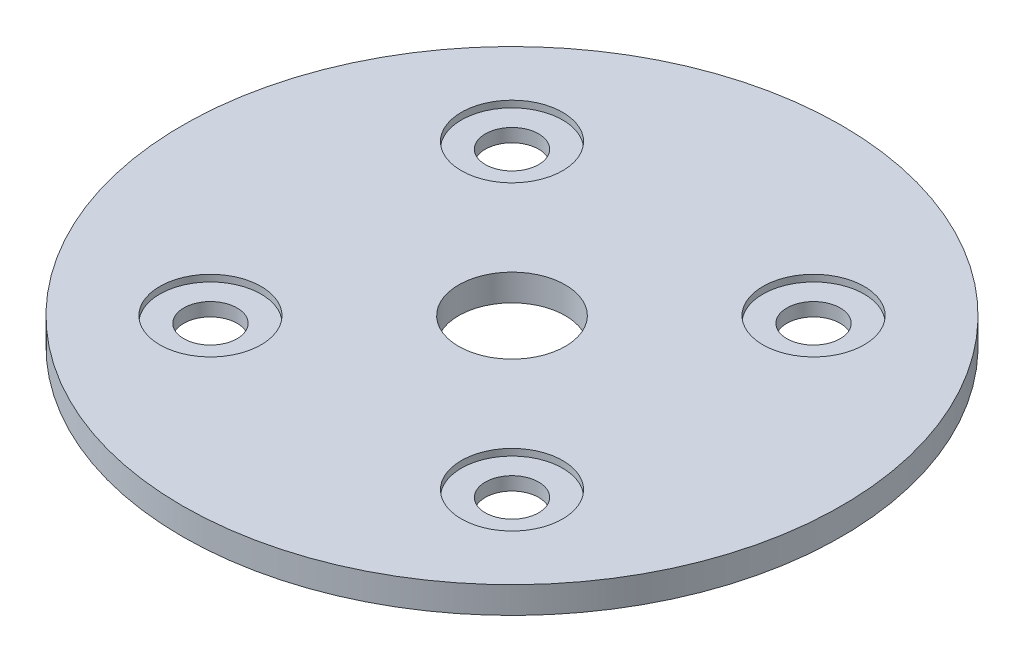
ISO-10303-21;
HEADER;
FILE_DESCRIPTION(('STEP AP214'),'2;1');
FILE_NAME('part.step','',(''),(''),'','','');
FILE_SCHEMA(('AUTOMOTIVE_DESIGN { 1 0 10303 214 1 1 1 1 }'));
ENDSEC;
DATA;
#1=APPLICATION_CONTEXT('core data for automotive mechanical design processes');
#2=APPLICATION_PROTOCOL_DEFINITION('international standard','automotive_design',2000,#1);
#3=PRODUCT_CONTEXT('',#1,'mechanical');
#4=PRODUCT('Part','Part','',(#3));
#5=PRODUCT_RELATED_PRODUCT_CATEGORY('part','',(#4));
#6=PRODUCT_DEFINITION_FORMATION('','',#4);
#7=PRODUCT_DEFINITION_CONTEXT('part definition',#1,'design');
#8=PRODUCT_DEFINITION('design','',#6,#7);
#9=PRODUCT_DEFINITION_SHAPE('','',#8);
#10=(LENGTH_UNIT() NAMED_UNIT(*) SI_UNIT(.MILLI.,.METRE.));
#11=(NAMED_UNIT(*) PLANE_ANGLE_UNIT() SI_UNIT($,.RADIAN.));
#12=(NAMED_UNIT(*) SI_UNIT($,.STERADIAN.) SOLID_ANGLE_UNIT());
#13=UNCERTAINTY_MEASURE_WITH_UNIT(LENGTH_MEASURE(1.E-05),#10,'distance_accuracy_value','');
#14=(GEOMETRIC_REPRESENTATION_CONTEXT(3) GLOBAL_UNCERTAINTY_ASSIGNED_CONTEXT((#13)) GLOBAL_UNIT_ASSIGNED_CONTEXT((#10,
#11,#12)) REPRESENTATION_CONTEXT('',''));
#15=CARTESIAN_POINT('',(0.,0.,0.));
#16=DIRECTION('',(0.,0.,1.));
#17=DIRECTION('',(1.,0.,0.));
#18=AXIS2_PLACEMENT_3D('',#15,#16,#17);
#19=CARTESIAN_POINT('',(-17.9605122421383,1.5875,17.9605122421383));
#20=DIRECTION('',(0.,1.,0.));
#21=DIRECTION('',(0.,0.,1.));
#22=AXIS2_PLACEMENT_3D('',#19,#20,#21);
#23=CYLINDRICAL_SURFACE('',#22,3.175);
#24=CARTESIAN_POINT('',(-17.9605122421383,0.79375,17.9605122421383));
#25=DIRECTION('',(0.,1.,0.));
#26=DIRECTION('',(0.,0.,1.));
#27=AXIS2_PLACEMENT_3D('',#24,#25,#26);
#28=CIRCLE('',#27,3.175);
#29=CARTESIAN_POINT('',(-17.9605122421383,0.79375,21.1355122421383));
#30=VERTEX_POINT('',#29);
#31=EDGE_CURVE('E65',#30,#30,#28,.F.);
#32=ORIENTED_EDGE('',*,*,#31,.F.);
#33=EDGE_LOOP('',(#32));
#34=FACE_BOUND('',#33,.T.);
#35=CARTESIAN_POINT('',(-17.9605122421383,-0.79375,17.9605122421383));
#36=DIRECTION('',(0.,-1.,0.));
#37=DIRECTION('',(0.,0.,-1.));
#38=AXIS2_PLACEMENT_3D('',#35,#36,#37);
#39=CIRCLE('',#38,3.175);
#40=CARTESIAN_POINT('',(-17.9605122421383,-0.79375,14.7855122421383));
#41=VERTEX_POINT('',#40);
#42=EDGE_CURVE('E41',#41,#41,#39,.F.);
#43=ORIENTED_EDGE('',*,*,#42,.F.);
#44=EDGE_LOOP('',(#43));
#45=FACE_BOUND('',#44,.T.);
#46=ADVANCED_FACE('F37',(#34,#45),#23,.F.);
#47=CARTESIAN_POINT('',(17.9605122421383,1.5875,17.9605122421383));
#48=DIRECTION('',(0.,1.,0.));
#49=DIRECTION('',(0.,0.,1.));
#50=AXIS2_PLACEMENT_3D('',#47,#48,#49);
#51=CYLINDRICAL_SURFACE('',#50,3.175);
#52=CARTESIAN_POINT('',(17.9605122421383,0.79375,17.9605122421383));
#53=DIRECTION('',(0.,1.,0.));
#54=DIRECTION('',(0.,0.,1.));
#55=AXIS2_PLACEMENT_3D('',#52,#53,#54);
#56=CIRCLE('',#55,3.175);
#57=CARTESIAN_POINT('',(17.9605122421383,0.79375,21.1355122421383));
#58=VERTEX_POINT('',#57);
#59=EDGE_CURVE('E62',#58,#58,#56,.F.);
#60=ORIENTED_EDGE('',*,*,#59,.F.);
#61=EDGE_LOOP('',(#60));
#62=FACE_BOUND('',#61,.T.);
#63=CARTESIAN_POINT('',(17.9605122421383,-0.79375,17.9605122421383));
#64=DIRECTION('',(0.,-1.,0.));
#65=DIRECTION('',(0.,0.,-1.));
#66=AXIS2_PLACEMENT_3D('',#63,#64,#65);
#67=CIRCLE('',#66,3.175);
#68=CARTESIAN_POINT('',(17.9605122421383,-0.79375,14.7855122421383));
#69=VERTEX_POINT('',#68);
#70=EDGE_CURVE('E75',#69,#69,#67,.F.);
#71=ORIENTED_EDGE('',*,*,#70,.F.);
#72=EDGE_LOOP('',(#71));
#73=FACE_BOUND('',#72,.T.);
#74=ADVANCED_FACE('F125',(#62,#73),#51,.F.);
#75=CARTESIAN_POINT('',(17.9605122421383,1.5875,-17.9605122421383));
#76=DIRECTION('',(0.,1.,0.));
#77=DIRECTION('',(0.,0.,1.));
#78=AXIS2_PLACEMENT_3D('',#75,#76,#77);
#79=CYLINDRICAL_SURFACE('',#78,3.175);
#80=CARTESIAN_POINT('',(17.9605122421383,0.79375,-17.9605122421383));
#81=DIRECTION('',(0.,1.,0.));
#82=DIRECTION('',(0.,0.,1.));
#83=AXIS2_PLACEMENT_3D('',#80,#81,#82);
#84=CIRCLE('',#83,3.175);
#85=CARTESIAN_POINT('',(17.9605122421383,0.79375,-14.7855122421383));
#86=VERTEX_POINT('',#85);
#87=EDGE_CURVE('E58',#86,#86,#84,.F.);
#88=ORIENTED_EDGE('',*,*,#87,.F.);
#89=EDGE_LOOP('',(#88));
#90=FACE_BOUND('',#89,.T.);
#91=CARTESIAN_POINT('',(17.9605122421383,-0.79375,-17.9605122421383));
#92=DIRECTION('',(0.,-1.,0.));
#93=DIRECTION('',(0.,0.,-1.));
#94=AXIS2_PLACEMENT_3D('',#91,#92,#93);
#95=CIRCLE('',#94,3.175);
#96=CARTESIAN_POINT('',(17.9605122421383,-0.79375,-21.1355122421383));
#97=VERTEX_POINT('',#96);
#98=EDGE_CURVE('E72',#97,#97,#95,.F.);
#99=ORIENTED_EDGE('',*,*,#98,.F.);
#100=EDGE_LOOP('',(#99));
#101=FACE_BOUND('',#100,.T.);
#102=ADVANCED_FACE('F132',(#90,#101),#79,.F.);
#103=CARTESIAN_POINT('',(-17.9605122421383,1.5875,-17.9605122421383));
#104=DIRECTION('',(0.,1.,0.));
#105=DIRECTION('',(0.,0.,1.));
#106=AXIS2_PLACEMENT_3D('',#103,#104,#105);
#107=CYLINDRICAL_SURFACE('',#106,3.175);
#108=CARTESIAN_POINT('',(-17.9605122421383,0.79375,-17.9605122421383));
#109=DIRECTION('',(0.,1.,0.));
#110=DIRECTION('',(0.,0.,1.));
#111=AXIS2_PLACEMENT_3D('',#108,#109,#110);
#112=CIRCLE('',#111,3.175);
#113=CARTESIAN_POINT('',(-17.9605122421383,0.79375,-14.7855122421383));
#114=VERTEX_POINT('',#113);
#115=EDGE_CURVE('E55',#114,#114,#112,.F.);
#116=ORIENTED_EDGE('',*,*,#115,.F.);
#117=EDGE_LOOP('',(#116));
#118=FACE_BOUND('',#117,.T.);
#119=CARTESIAN_POINT('',(-17.9605122421383,-0.79375,-17.9605122421383));
#120=DIRECTION('',(0.,-1.,0.));
#121=DIRECTION('',(0.,0.,-1.));
#122=AXIS2_PLACEMENT_3D('',#119,#120,#121);
#123=CIRCLE('',#122,3.175);
#124=CARTESIAN_POINT('',(-17.9605122421383,-0.79375,-21.1355122421383));
#125=VERTEX_POINT('',#124);
#126=EDGE_CURVE('E69',#125,#125,#123,.F.);
#127=ORIENTED_EDGE('',*,*,#126,.F.);
#128=EDGE_LOOP('',(#127));
#129=FACE_BOUND('',#128,.T.);
#130=ADVANCED_FACE('F142',(#118,#129),#107,.F.);
#131=CARTESIAN_POINT('',(0.,1.5875,0.));
#132=DIRECTION('',(0.,-1.,0.));
#133=DIRECTION('',(0.,0.,-1.));
#134=AXIS2_PLACEMENT_3D('',#131,#132,#133);
#135=CYLINDRICAL_SURFACE('',#134,39.2557);
#136=CARTESIAN_POINT('',(0.,1.5875,0.));
#137=DIRECTION('',(0.,1.,0.));
#138=DIRECTION('',(0.,0.,1.));
#139=AXIS2_PLACEMENT_3D('',#136,#137,#138);
#140=CIRCLE('',#139,39.2557);
#141=CARTESIAN_POINT('',(0.,1.5875,39.2557));
#142=VERTEX_POINT('',#141);
#143=EDGE_CURVE('E10',#142,#142,#140,.T.);
#144=ORIENTED_EDGE('',*,*,#143,.F.);
#145=EDGE_LOOP('',(#144));
#146=FACE_BOUND('',#145,.T.);
#147=CARTESIAN_POINT('',(0.,-1.5875,0.));
#148=DIRECTION('',(0.,1.,0.));
#149=DIRECTION('',(0.,0.,1.));
#150=AXIS2_PLACEMENT_3D('',#147,#148,#149);
#151=CIRCLE('',#150,39.2557);
#152=CARTESIAN_POINT('',(0.,-1.5875,39.2557));
#153=VERTEX_POINT('',#152);
#154=EDGE_CURVE('E45',#153,#153,#151,.T.);
#155=ORIENTED_EDGE('',*,*,#154,.T.);
#156=EDGE_LOOP('',(#155));
#157=FACE_BOUND('',#156,.T.);
#158=ADVANCED_FACE('F39',(#146,#157),#135,.T.);
#159=CARTESIAN_POINT('',(0.,1.5875,0.));
#160=DIRECTION('',(0.,1.,0.));
#161=DIRECTION('',(0.,0.,1.));
#162=AXIS2_PLACEMENT_3D('',#159,#160,#161);
#163=PLANE('',#162);
#164=CARTESIAN_POINT('',(-17.9605122421383,1.5875,17.9605122421383));
#165=DIRECTION('',(0.,1.,0.));
#166=DIRECTION('',(0.,0.,1.));
#167=AXIS2_PLACEMENT_3D('',#164,#165,#166);
#168=CIRCLE('',#167,6.0325);
#169=CARTESIAN_POINT('',(-17.9605122421383,1.5875,23.9930122421383));
#170=VERTEX_POINT('',#169);
#171=EDGE_CURVE('E84',#170,#170,#168,.T.);
#172=ORIENTED_EDGE('',*,*,#171,.F.);
#173=EDGE_LOOP('',(#172));
#174=FACE_BOUND('',#173,.T.);
#175=CARTESIAN_POINT('',(17.9605122421383,1.5875,17.9605122421383));
#176=DIRECTION('',(0.,1.,0.));
#177=DIRECTION('',(0.,0.,1.));
#178=AXIS2_PLACEMENT_3D('',#175,#176,#177);
#179=CIRCLE('',#178,6.0325);
#180=CARTESIAN_POINT('',(17.9605122421383,1.5875,23.9930122421383));
#181=VERTEX_POINT('',#180);
#182=EDGE_CURVE('E149',#181,#181,#179,.T.);
#183=ORIENTED_EDGE('',*,*,#182,.F.);
#184=EDGE_LOOP('',(#183));
#185=FACE_BOUND('',#184,.T.);
#186=CARTESIAN_POINT('',(17.9605122421383,1.5875,-17.9605122421383));
#187=DIRECTION('',(0.,1.,0.));
#188=DIRECTION('',(0.,0.,1.));
#189=AXIS2_PLACEMENT_3D('',#186,#187,#188);
#190=CIRCLE('',#189,6.0325);
#191=CARTESIAN_POINT('',(17.9605122421383,1.5875,-11.9280122421383));
#192=VERTEX_POINT('',#191);
#193=EDGE_CURVE('E97',#192,#192,#190,.T.);
#194=ORIENTED_EDGE('',*,*,#193,.F.);
#195=EDGE_LOOP('',(#194));
#196=FACE_BOUND('',#195,.T.);
#197=CARTESIAN_POINT('',(-17.9605122421383,1.5875,-17.9605122421383));
#198=DIRECTION('',(0.,1.,0.));
#199=DIRECTION('',(0.,0.,1.));
#200=AXIS2_PLACEMENT_3D('',#197,#198,#199);
#201=CIRCLE('',#200,6.0325);
#202=CARTESIAN_POINT('',(-17.9605122421383,1.5875,-11.9280122421383));
#203=VERTEX_POINT('',#202);
#204=EDGE_CURVE('E95',#203,#203,#201,.T.);
#205=ORIENTED_EDGE('',*,*,#204,.F.);
#206=EDGE_LOOP('',(#205));
#207=FACE_BOUND('',#206,.T.);
#208=CARTESIAN_POINT('',(0.,1.5875,0.));
#209=DIRECTION('',(0.,1.,0.));
#210=DIRECTION('',(0.,0.,1.));
#211=AXIS2_PLACEMENT_3D('',#208,#209,#210);
#212=CIRCLE('',#211,6.35);
#213=CARTESIAN_POINT('',(0.,1.5875,6.35));
#214=VERTEX_POINT('',#213);
#215=EDGE_CURVE('E68',#214,#214,#212,.T.);
#216=ORIENTED_EDGE('',*,*,#215,.F.);
#217=EDGE_LOOP('',(#216));
#218=FACE_BOUND('',#217,.T.);
#219=ORIENTED_EDGE('',*,*,#143,.T.);
#220=EDGE_LOOP('',(#219));
#221=FACE_BOUND('',#220,.T.);
#222=ADVANCED_FACE('F120',(#174,#185,#196,#207,#218,#221),#163,.T.);
#223=CARTESIAN_POINT('',(0.,-1.5875,0.));
#224=DIRECTION('',(0.,1.,0.));
#225=DIRECTION('',(0.,0.,1.));
#226=AXIS2_PLACEMENT_3D('',#223,#224,#225);
#227=PLANE('',#226);
#228=CARTESIAN_POINT('',(-17.9605122421383,-1.5875,17.9605122421383));
#229=DIRECTION('',(0.,1.,0.));
#230=DIRECTION('',(0.,0.,1.));
#231=AXIS2_PLACEMENT_3D('',#228,#229,#230);
#232=CIRCLE('',#231,6.0325);
#233=CARTESIAN_POINT('',(-17.9605122421383,-1.5875,23.9930122421383));
#234=VERTEX_POINT('',#233);
#235=EDGE_CURVE('E385',#234,#234,#232,.T.);
#236=ORIENTED_EDGE('',*,*,#235,.T.);
#237=EDGE_LOOP('',(#236));
#238=FACE_BOUND('',#237,.T.);
#239=CARTESIAN_POINT('',(17.9605122421383,-1.5875,17.9605122421383));
#240=DIRECTION('',(0.,1.,0.));
#241=DIRECTION('',(0.,0.,1.));
#242=AXIS2_PLACEMENT_3D('',#239,#240,#241);
#243=CIRCLE('',#242,6.0325);
#244=CARTESIAN_POINT('',(17.9605122421383,-1.5875,23.9930122421383));
#245=VERTEX_POINT('',#244);
#246=EDGE_CURVE('E379',#245,#245,#243,.T.);
#247=ORIENTED_EDGE('',*,*,#246,.T.);
#248=EDGE_LOOP('',(#247));
#249=FACE_BOUND('',#248,.T.);
#250=CARTESIAN_POINT('',(17.9605122421383,-1.5875,-17.9605122421383));
#251=DIRECTION('',(0.,1.,0.));
#252=DIRECTION('',(0.,0.,1.));
#253=AXIS2_PLACEMENT_3D('',#250,#251,#252);
#254=CIRCLE('',#253,6.0325);
#255=CARTESIAN_POINT('',(17.9605122421383,-1.5875,-11.9280122421383));
#256=VERTEX_POINT('',#255);
#257=EDGE_CURVE('E369',#256,#256,#254,.T.);
#258=ORIENTED_EDGE('',*,*,#257,.T.);
#259=EDGE_LOOP('',(#258));
#260=FACE_BOUND('',#259,.T.);
#261=CARTESIAN_POINT('',(-17.9605122421383,-1.5875,-17.9605122421383));
#262=DIRECTION('',(0.,1.,0.));
#263=DIRECTION('',(0.,0.,1.));
#264=AXIS2_PLACEMENT_3D('',#261,#262,#263);
#265=CIRCLE('',#264,6.0325);
#266=CARTESIAN_POINT('',(-17.9605122421383,-1.5875,-11.9280122421383));
#267=VERTEX_POINT('',#266);
#268=EDGE_CURVE('E368',#267,#267,#265,.T.);
#269=ORIENTED_EDGE('',*,*,#268,.T.);
#270=EDGE_LOOP('',(#269));
#271=FACE_BOUND('',#270,.T.);
#272=CARTESIAN_POINT('',(0.,-1.5875,0.));
#273=DIRECTION('',(0.,1.,0.));
#274=DIRECTION('',(0.,0.,1.));
#275=AXIS2_PLACEMENT_3D('',#272,#273,#274);
#276=CIRCLE('',#275,6.35);
#277=CARTESIAN_POINT('',(0.,-1.5875,6.35));
#278=VERTEX_POINT('',#277);
#279=EDGE_CURVE('E50',#278,#278,#276,.T.);
#280=ORIENTED_EDGE('',*,*,#279,.T.);
#281=EDGE_LOOP('',(#280));
#282=FACE_BOUND('',#281,.T.);
#283=ORIENTED_EDGE('',*,*,#154,.F.);
#284=EDGE_LOOP('',(#283));
#285=FACE_BOUND('',#284,.T.);
#286=ADVANCED_FACE('F104',(#238,#249,#260,#271,#282,#285),#227,.F.);
#287=CARTESIAN_POINT('',(0.,1.5875,0.));
#288=DIRECTION('',(0.,1.,0.));
#289=DIRECTION('',(0.,0.,1.));
#290=AXIS2_PLACEMENT_3D('',#287,#288,#289);
#291=CYLINDRICAL_SURFACE('',#290,6.35);
#292=ORIENTED_EDGE('',*,*,#279,.F.);
#293=EDGE_LOOP('',(#292));
#294=FACE_BOUND('',#293,.T.);
#295=ORIENTED_EDGE('',*,*,#215,.T.);
#296=EDGE_LOOP('',(#295));
#297=FACE_BOUND('',#296,.T.);
#298=ADVANCED_FACE('F107',(#294,#297),#291,.F.);
#299=CARTESIAN_POINT('',(-17.9605122421383,0.79375,-17.9605122421383));
#300=DIRECTION('',(0.,1.,0.));
#301=DIRECTION('',(0.,0.,1.));
#302=AXIS2_PLACEMENT_3D('',#299,#300,#301);
#303=PLANE('',#302);
#304=CARTESIAN_POINT('',(-17.9605122421383,0.79375,-17.9605122421383));
#305=DIRECTION('',(0.,1.,0.));
#306=DIRECTION('',(0.,0.,1.));
#307=AXIS2_PLACEMENT_3D('',#304,#305,#306);
#308=CIRCLE('',#307,6.0325);
#309=CARTESIAN_POINT('',(-17.9605122421383,0.79375,-11.9280122421383));
#310=VERTEX_POINT('',#309);
#311=EDGE_CURVE('E59',#310,#310,#308,.T.);
#312=ORIENTED_EDGE('',*,*,#311,.T.);
#313=EDGE_LOOP('',(#312));
#314=FACE_BOUND('',#313,.T.);
#315=ORIENTED_EDGE('',*,*,#115,.T.);
#316=EDGE_LOOP('',(#315));
#317=FACE_BOUND('',#316,.T.);
#318=ADVANCED_FACE('F109',(#314,#317),#303,.T.);
#319=CARTESIAN_POINT('',(-17.9605122421383,0.79375,-17.9605122421383));
#320=DIRECTION('',(0.,1.,0.));
#321=DIRECTION('',(0.,0.,1.));
#322=AXIS2_PLACEMENT_3D('',#319,#320,#321);
#323=CYLINDRICAL_SURFACE('',#322,6.0325);
#324=ORIENTED_EDGE('',*,*,#311,.F.);
#325=EDGE_LOOP('',(#324));
#326=FACE_BOUND('',#325,.T.);
#327=ORIENTED_EDGE('',*,*,#204,.T.);
#328=EDGE_LOOP('',(#327));
#329=FACE_BOUND('',#328,.T.);
#330=ADVANCED_FACE('F116',(#326,#329),#323,.F.);
#331=CARTESIAN_POINT('',(17.9605122421383,0.79375,-17.9605122421383));
#332=DIRECTION('',(0.,1.,0.));
#333=DIRECTION('',(0.,0.,1.));
#334=AXIS2_PLACEMENT_3D('',#331,#332,#333);
#335=PLANE('',#334);
#336=CARTESIAN_POINT('',(17.9605122421383,0.79375,-17.9605122421383));
#337=DIRECTION('',(0.,1.,0.));
#338=DIRECTION('',(0.,0.,1.));
#339=AXIS2_PLACEMENT_3D('',#336,#337,#338);
#340=CIRCLE('',#339,6.0325);
#341=CARTESIAN_POINT('',(17.9605122421383,0.79375,-11.9280122421383));
#342=VERTEX_POINT('',#341);
#343=EDGE_CURVE('E391',#342,#342,#340,.T.);
#344=ORIENTED_EDGE('',*,*,#343,.T.);
#345=EDGE_LOOP('',(#344));
#346=FACE_BOUND('',#345,.T.);
#347=ORIENTED_EDGE('',*,*,#87,.T.);
#348=EDGE_LOOP('',(#347));
#349=FACE_BOUND('',#348,.T.);
#350=ADVANCED_FACE('F157',(#346,#349),#335,.T.);
#351=CARTESIAN_POINT('',(17.9605122421383,0.79375,-17.9605122421383));
#352=DIRECTION('',(0.,1.,0.));
#353=DIRECTION('',(0.,0.,1.));
#354=AXIS2_PLACEMENT_3D('',#351,#352,#353);
#355=CYLINDRICAL_SURFACE('',#354,6.0325);
#356=ORIENTED_EDGE('',*,*,#343,.F.);
#357=EDGE_LOOP('',(#356));
#358=FACE_BOUND('',#357,.T.);
#359=ORIENTED_EDGE('',*,*,#193,.T.);
#360=EDGE_LOOP('',(#359));
#361=FACE_BOUND('',#360,.T.);
#362=ADVANCED_FACE('F162',(#358,#361),#355,.F.);
#363=CARTESIAN_POINT('',(17.9605122421383,0.79375,17.9605122421383));
#364=DIRECTION('',(0.,1.,0.));
#365=DIRECTION('',(0.,0.,1.));
#366=AXIS2_PLACEMENT_3D('',#363,#364,#365);
#367=PLANE('',#366);
#368=CARTESIAN_POINT('',(17.9605122421383,0.79375,17.9605122421383));
#369=DIRECTION('',(0.,1.,0.));
#370=DIRECTION('',(0.,0.,1.));
#371=AXIS2_PLACEMENT_3D('',#368,#369,#370);
#372=CIRCLE('',#371,6.0325);
#373=CARTESIAN_POINT('',(17.9605122421383,0.79375,23.9930122421383));
#374=VERTEX_POINT('',#373);
#375=EDGE_CURVE('E89',#374,#374,#372,.T.);
#376=ORIENTED_EDGE('',*,*,#375,.T.);
#377=EDGE_LOOP('',(#376));
#378=FACE_BOUND('',#377,.T.);
#379=ORIENTED_EDGE('',*,*,#59,.T.);
#380=EDGE_LOOP('',(#379));
#381=FACE_BOUND('',#380,.T.);
#382=ADVANCED_FACE('F175',(#378,#381),#367,.T.);
#383=CARTESIAN_POINT('',(17.9605122421383,0.79375,17.9605122421383));
#384=DIRECTION('',(0.,1.,0.));
#385=DIRECTION('',(0.,0.,1.));
#386=AXIS2_PLACEMENT_3D('',#383,#384,#385);
#387=CYLINDRICAL_SURFACE('',#386,6.0325);
#388=ORIENTED_EDGE('',*,*,#375,.F.);
#389=EDGE_LOOP('',(#388));
#390=FACE_BOUND('',#389,.T.);
#391=ORIENTED_EDGE('',*,*,#182,.T.);
#392=EDGE_LOOP('',(#391));
#393=FACE_BOUND('',#392,.T.);
#394=ADVANCED_FACE('F171',(#390,#393),#387,.F.);
#395=CARTESIAN_POINT('',(-17.9605122421383,0.79375,17.9605122421383));
#396=DIRECTION('',(0.,1.,0.));
#397=DIRECTION('',(0.,0.,1.));
#398=AXIS2_PLACEMENT_3D('',#395,#396,#397);
#399=PLANE('',#398);
#400=CARTESIAN_POINT('',(-17.9605122421383,0.79375,17.9605122421383));
#401=DIRECTION('',(0.,1.,0.));
#402=DIRECTION('',(0.,0.,1.));
#403=AXIS2_PLACEMENT_3D('',#400,#401,#402);
#404=CIRCLE('',#403,6.0325);
#405=CARTESIAN_POINT('',(-17.9605122421383,0.79375,23.9930122421383));
#406=VERTEX_POINT('',#405);
#407=EDGE_CURVE('E80',#406,#406,#404,.T.);
#408=ORIENTED_EDGE('',*,*,#407,.T.);
#409=EDGE_LOOP('',(#408));
#410=FACE_BOUND('',#409,.T.);
#411=ORIENTED_EDGE('',*,*,#31,.T.);
#412=EDGE_LOOP('',(#411));
#413=FACE_BOUND('',#412,.T.);
#414=ADVANCED_FACE('F167',(#410,#413),#399,.T.);
#415=CARTESIAN_POINT('',(-17.9605122421383,0.79375,17.9605122421383));
#416=DIRECTION('',(0.,1.,0.));
#417=DIRECTION('',(0.,0.,1.));
#418=AXIS2_PLACEMENT_3D('',#415,#416,#417);
#419=CYLINDRICAL_SURFACE('',#418,6.0325);
#420=ORIENTED_EDGE('',*,*,#407,.F.);
#421=EDGE_LOOP('',(#420));
#422=FACE_BOUND('',#421,.T.);
#423=ORIENTED_EDGE('',*,*,#171,.T.);
#424=EDGE_LOOP('',(#423));
#425=FACE_BOUND('',#424,.T.);
#426=ADVANCED_FACE('F170',(#422,#425),#419,.F.);
#427=CARTESIAN_POINT('',(-17.9605122421383,-0.79375,-17.9605122421383));
#428=DIRECTION('',(0.,-1.,0.));
#429=DIRECTION('',(0.,0.,1.));
#430=AXIS2_PLACEMENT_3D('',#427,#428,#429);
#431=PLANE('',#430);
#432=CARTESIAN_POINT('',(-17.9605122421383,-0.79375,-17.9605122421383));
#433=DIRECTION('',(0.,1.,0.));
#434=DIRECTION('',(0.,0.,1.));
#435=AXIS2_PLACEMENT_3D('',#432,#433,#434);
#436=CIRCLE('',#435,6.0325);
#437=CARTESIAN_POINT('',(-17.9605122421383,-0.79375,-11.9280122421383));
#438=VERTEX_POINT('',#437);
#439=EDGE_CURVE('E73',#438,#438,#436,.T.);
#440=ORIENTED_EDGE('',*,*,#439,.F.);
#441=EDGE_LOOP('',(#440));
#442=FACE_BOUND('',#441,.T.);
#443=ORIENTED_EDGE('',*,*,#126,.T.);
#444=EDGE_LOOP('',(#443));
#445=FACE_BOUND('',#444,.T.);
#446=ADVANCED_FACE('F173',(#442,#445),#431,.T.);
#447=CARTESIAN_POINT('',(-17.9605122421383,-0.79375,-17.9605122421383));
#448=DIRECTION('',(0.,-1.,0.));
#449=DIRECTION('',(0.,0.,-1.));
#450=AXIS2_PLACEMENT_3D('',#447,#448,#449);
#451=CYLINDRICAL_SURFACE('',#450,6.0325);
#452=ORIENTED_EDGE('',*,*,#439,.T.);
#453=EDGE_LOOP('',(#452));
#454=FACE_BOUND('',#453,.T.);
#455=ORIENTED_EDGE('',*,*,#268,.F.);
#456=EDGE_LOOP('',(#455));
#457=FACE_BOUND('',#456,.T.);
#458=ADVANCED_FACE('F185',(#454,#457),#451,.F.);
#459=CARTESIAN_POINT('',(17.9605122421383,-0.79375,-17.9605122421383));
#460=DIRECTION('',(0.,-1.,0.));
#461=DIRECTION('',(0.,0.,1.));
#462=AXIS2_PLACEMENT_3D('',#459,#460,#461);
#463=PLANE('',#462);
#464=CARTESIAN_POINT('',(17.9605122421383,-0.79375,-17.9605122421383));
#465=DIRECTION('',(0.,1.,0.));
#466=DIRECTION('',(0.,0.,1.));
#467=AXIS2_PLACEMENT_3D('',#464,#465,#466);
#468=CIRCLE('',#467,6.0325);
#469=CARTESIAN_POINT('',(17.9605122421383,-0.79375,-11.9280122421383));
#470=VERTEX_POINT('',#469);
#471=EDGE_CURVE('E220',#470,#470,#468,.T.);
#472=ORIENTED_EDGE('',*,*,#471,.F.);
#473=EDGE_LOOP('',(#472));
#474=FACE_BOUND('',#473,.T.);
#475=ORIENTED_EDGE('',*,*,#98,.T.);
#476=EDGE_LOOP('',(#475));
#477=FACE_BOUND('',#476,.T.);
#478=ADVANCED_FACE('F188',(#474,#477),#463,.T.);
#479=CARTESIAN_POINT('',(17.9605122421383,-0.79375,-17.9605122421383));
#480=DIRECTION('',(0.,-1.,0.));
#481=DIRECTION('',(0.,0.,-1.));
#482=AXIS2_PLACEMENT_3D('',#479,#480,#481);
#483=CYLINDRICAL_SURFACE('',#482,6.0325);
#484=ORIENTED_EDGE('',*,*,#471,.T.);
#485=EDGE_LOOP('',(#484));
#486=FACE_BOUND('',#485,.T.);
#487=ORIENTED_EDGE('',*,*,#257,.F.);
#488=EDGE_LOOP('',(#487));
#489=FACE_BOUND('',#488,.T.);
#490=ADVANCED_FACE('F208',(#486,#489),#483,.F.);
#491=CARTESIAN_POINT('',(17.9605122421383,-0.79375,17.9605122421383));
#492=DIRECTION('',(0.,-1.,0.));
#493=DIRECTION('',(0.,0.,1.));
#494=AXIS2_PLACEMENT_3D('',#491,#492,#493);
#495=PLANE('',#494);
#496=CARTESIAN_POINT('',(17.9605122421383,-0.79375,17.9605122421383));
#497=DIRECTION('',(0.,1.,0.));
#498=DIRECTION('',(0.,0.,1.));
#499=AXIS2_PLACEMENT_3D('',#496,#497,#498);
#500=CIRCLE('',#499,6.0325);
#501=CARTESIAN_POINT('',(17.9605122421383,-0.79375,23.9930122421383));
#502=VERTEX_POINT('',#501);
#503=EDGE_CURVE('E374',#502,#502,#500,.T.);
#504=ORIENTED_EDGE('',*,*,#503,.F.);
#505=EDGE_LOOP('',(#504));
#506=FACE_BOUND('',#505,.T.);
#507=ORIENTED_EDGE('',*,*,#70,.T.);
#508=EDGE_LOOP('',(#507));
#509=FACE_BOUND('',#508,.T.);
#510=ADVANCED_FACE('F204',(#506,#509),#495,.T.);
#511=CARTESIAN_POINT('',(17.9605122421383,-0.79375,17.9605122421383));
#512=DIRECTION('',(0.,-1.,0.));
#513=DIRECTION('',(0.,0.,-1.));
#514=AXIS2_PLACEMENT_3D('',#511,#512,#513);
#515=CYLINDRICAL_SURFACE('',#514,6.0325);
#516=ORIENTED_EDGE('',*,*,#503,.T.);
#517=EDGE_LOOP('',(#516));
#518=FACE_BOUND('',#517,.T.);
#519=ORIENTED_EDGE('',*,*,#246,.F.);
#520=EDGE_LOOP('',(#519));
#521=FACE_BOUND('',#520,.T.);
#522=ADVANCED_FACE('F200',(#518,#521),#515,.F.);
#523=CARTESIAN_POINT('',(-17.9605122421383,-0.79375,17.9605122421383));
#524=DIRECTION('',(0.,-1.,0.));
#525=DIRECTION('',(0.,0.,1.));
#526=AXIS2_PLACEMENT_3D('',#523,#524,#525);
#527=PLANE('',#526);
#528=CARTESIAN_POINT('',(-17.9605122421383,-0.79375,17.9605122421383));
#529=DIRECTION('',(0.,1.,0.));
#530=DIRECTION('',(0.,0.,1.));
#531=AXIS2_PLACEMENT_3D('',#528,#529,#530);
#532=CIRCLE('',#531,6.0325);
#533=CARTESIAN_POINT('',(-17.9605122421383,-0.79375,23.9930122421383));
#534=VERTEX_POINT('',#533);
#535=EDGE_CURVE('E382',#534,#534,#532,.T.);
#536=ORIENTED_EDGE('',*,*,#535,.F.);
#537=EDGE_LOOP('',(#536));
#538=FACE_BOUND('',#537,.T.);
#539=ORIENTED_EDGE('',*,*,#42,.T.);
#540=EDGE_LOOP('',(#539));
#541=FACE_BOUND('',#540,.T.);
#542=ADVANCED_FACE('F196',(#538,#541),#527,.T.);
#543=CARTESIAN_POINT('',(-17.9605122421383,-0.79375,17.9605122421383));
#544=DIRECTION('',(0.,-1.,0.));
#545=DIRECTION('',(0.,0.,-1.));
#546=AXIS2_PLACEMENT_3D('',#543,#544,#545);
#547=CYLINDRICAL_SURFACE('',#546,6.0325);
#548=ORIENTED_EDGE('',*,*,#535,.T.);
#549=EDGE_LOOP('',(#548));
#550=FACE_BOUND('',#549,.T.);
#551=ORIENTED_EDGE('',*,*,#235,.F.);
#552=EDGE_LOOP('',(#551));
#553=FACE_BOUND('',#552,.T.);
#554=ADVANCED_FACE('F193',(#550,#553),#547,.F.);
#555=CLOSED_SHELL('',(#46,#74,#102,#130,#158,#222,#286,#298,#318,#330,#350,#362,#382,#394,#414,
#426,#446,#458,#478,#490,#510,#522,#542,#554));
#556=MANIFOLD_SOLID_BREP('B2',#555);
#557=ADVANCED_BREP_SHAPE_REPRESENTATION('',(#18,#556),#14);
#558=SHAPE_DEFINITION_REPRESENTATION(#9,#557);
ENDSEC;
END-ISO-10303-21;
